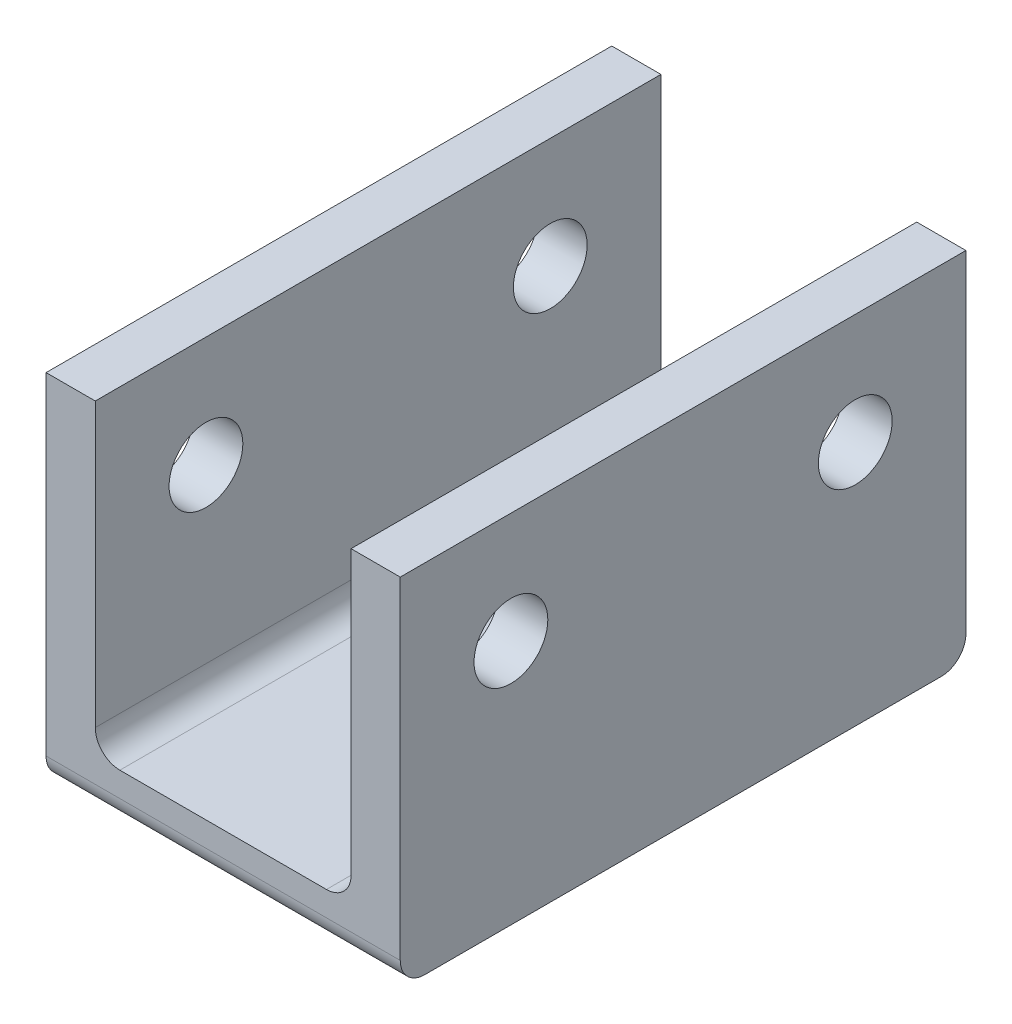
ISO-10303-21;
HEADER;
FILE_DESCRIPTION(('STEP AP214'),'2;1');
FILE_NAME('part.step','',(''),(''),'','','');
FILE_SCHEMA(('AUTOMOTIVE_DESIGN { 1 0 10303 214 1 1 1 1 }'));
ENDSEC;
DATA;
#1=APPLICATION_CONTEXT('core data for automotive mechanical design processes');
#2=APPLICATION_PROTOCOL_DEFINITION('international standard','automotive_design',2000,#1);
#3=PRODUCT_CONTEXT('',#1,'mechanical');
#4=PRODUCT('Part','Part','',(#3));
#5=PRODUCT_RELATED_PRODUCT_CATEGORY('part','',(#4));
#6=PRODUCT_DEFINITION_FORMATION('','',#4);
#7=PRODUCT_DEFINITION_CONTEXT('part definition',#1,'design');
#8=PRODUCT_DEFINITION('design','',#6,#7);
#9=PRODUCT_DEFINITION_SHAPE('','',#8);
#10=(LENGTH_UNIT() NAMED_UNIT(*) SI_UNIT(.MILLI.,.METRE.));
#11=(NAMED_UNIT(*) PLANE_ANGLE_UNIT() SI_UNIT($,.RADIAN.));
#12=(NAMED_UNIT(*) SI_UNIT($,.STERADIAN.) SOLID_ANGLE_UNIT());
#13=UNCERTAINTY_MEASURE_WITH_UNIT(LENGTH_MEASURE(1.E-05),#10,'distance_accuracy_value','');
#14=(GEOMETRIC_REPRESENTATION_CONTEXT(3) GLOBAL_UNCERTAINTY_ASSIGNED_CONTEXT((#13)) GLOBAL_UNIT_ASSIGNED_CONTEXT((#10,
#11,#12)) REPRESENTATION_CONTEXT('',''));
#15=CARTESIAN_POINT('',(0.,0.,0.));
#16=DIRECTION('',(0.,0.,1.));
#17=DIRECTION('',(1.,0.,0.));
#18=AXIS2_PLACEMENT_3D('',#15,#16,#17);
#19=CARTESIAN_POINT('',(-5.2,1.,11.5));
#20=DIRECTION('',(-1.,0.,0.));
#21=DIRECTION('',(0.,-1.,0.));
#22=AXIS2_PLACEMENT_3D('',#19,#20,#21);
#23=PLANE('',#22);
#24=CARTESIAN_POINT('',(-5.2,9.,7.));
#25=DIRECTION('',(-1.,0.,0.));
#26=DIRECTION('',(0.,-1.,0.));
#27=AXIS2_PLACEMENT_3D('',#24,#25,#26);
#28=CIRCLE('',#27,1.5);
#29=CARTESIAN_POINT('',(-5.2,7.5,7.));
#30=VERTEX_POINT('',#29);
#31=EDGE_CURVE('E255',#30,#30,#28,.T.);
#32=ORIENTED_EDGE('',*,*,#31,.T.);
#33=EDGE_LOOP('',(#32));
#34=FACE_BOUND('',#33,.T.);
#35=CARTESIAN_POINT('',(-5.2,9.,-7.));
#36=DIRECTION('',(-1.,0.,0.));
#37=DIRECTION('',(0.,-1.,0.));
#38=AXIS2_PLACEMENT_3D('',#35,#36,#37);
#39=CIRCLE('',#38,1.5);
#40=CARTESIAN_POINT('',(-5.2,7.5,-7.));
#41=VERTEX_POINT('',#40);
#42=EDGE_CURVE('E165',#41,#41,#39,.T.);
#43=ORIENTED_EDGE('',*,*,#42,.T.);
#44=EDGE_LOOP('',(#43));
#45=FACE_BOUND('',#44,.T.);
#46=DIRECTION('',(0.,1.,0.));
#47=VECTOR('',#46,1.);
#48=CARTESIAN_POINT('',(-5.2,1.,11.5));
#49=LINE('',#48,#47);
#50=CARTESIAN_POINT('',(-5.2,2.,11.5));
#51=VERTEX_POINT('',#50);
#52=CARTESIAN_POINT('',(-5.2,13.5,11.5));
#53=VERTEX_POINT('',#52);
#54=EDGE_CURVE('E121',#51,#53,#49,.T.);
#55=ORIENTED_EDGE('',*,*,#54,.F.);
#56=DIRECTION('',(0.,0.,-1.));
#57=VECTOR('',#56,1.);
#58=CARTESIAN_POINT('',(-5.2,2.,-11.5));
#59=LINE('',#58,#57);
#60=CARTESIAN_POINT('',(-5.2,2.,-11.5));
#61=VERTEX_POINT('',#60);
#62=EDGE_CURVE('E181',#51,#61,#59,.T.);
#63=ORIENTED_EDGE('',*,*,#62,.T.);
#64=DIRECTION('',(0.,1.,0.));
#65=VECTOR('',#64,1.);
#66=CARTESIAN_POINT('',(-5.2,1.,-11.5));
#67=LINE('',#66,#65);
#68=CARTESIAN_POINT('',(-5.2,13.5,-11.5));
#69=VERTEX_POINT('',#68);
#70=EDGE_CURVE('E146',#61,#69,#67,.T.);
#71=ORIENTED_EDGE('',*,*,#70,.T.);
#72=DIRECTION('',(0.,0.,-1.));
#73=VECTOR('',#72,1.);
#74=CARTESIAN_POINT('',(-5.2,13.5,11.5));
#75=LINE('',#74,#73);
#76=EDGE_CURVE('E139',#53,#69,#75,.T.);
#77=ORIENTED_EDGE('',*,*,#76,.F.);
#78=EDGE_LOOP('',(#55,#63,#71,#77));
#79=FACE_BOUND('',#78,.T.);
#80=ADVANCED_FACE('F33',(#34,#45,#79),#23,.F.);
#81=CARTESIAN_POINT('',(-5.2,13.5,11.5));
#82=DIRECTION('',(0.,-1.,0.));
#83=DIRECTION('',(0.,0.,-1.));
#84=AXIS2_PLACEMENT_3D('',#81,#82,#83);
#85=PLANE('',#84);
#86=DIRECTION('',(-1.,0.,0.));
#87=VECTOR('',#86,1.);
#88=CARTESIAN_POINT('',(-5.2,13.5,-11.5));
#89=LINE('',#88,#87);
#90=CARTESIAN_POINT('',(-7.2,13.5,-11.5));
#91=VERTEX_POINT('',#90);
#92=EDGE_CURVE('E254',#69,#91,#89,.T.);
#93=ORIENTED_EDGE('',*,*,#92,.T.);
#94=DIRECTION('',(0.,0.,-1.));
#95=VECTOR('',#94,1.);
#96=CARTESIAN_POINT('',(-7.2,13.5,11.5));
#97=LINE('',#96,#95);
#98=CARTESIAN_POINT('',(-7.2,13.5,11.5));
#99=VERTEX_POINT('',#98);
#100=EDGE_CURVE('E141',#99,#91,#97,.T.);
#101=ORIENTED_EDGE('',*,*,#100,.F.);
#102=DIRECTION('',(-1.,0.,0.));
#103=VECTOR('',#102,1.);
#104=CARTESIAN_POINT('',(-5.2,13.5,11.5));
#105=LINE('',#104,#103);
#106=EDGE_CURVE('E125',#53,#99,#105,.T.);
#107=ORIENTED_EDGE('',*,*,#106,.F.);
#108=ORIENTED_EDGE('',*,*,#76,.T.);
#109=EDGE_LOOP('',(#93,#101,#107,#108));
#110=FACE_BOUND('',#109,.T.);
#111=ADVANCED_FACE('F138',(#110),#85,.F.);
#112=CARTESIAN_POINT('',(-7.2,13.5,11.5));
#113=DIRECTION('',(1.,0.,0.));
#114=DIRECTION('',(0.,1.,0.));
#115=AXIS2_PLACEMENT_3D('',#112,#113,#114);
#116=PLANE('',#115);
#117=CARTESIAN_POINT('',(-7.2,9.,7.));
#118=DIRECTION('',(1.,0.,0.));
#119=DIRECTION('',(0.,1.,0.));
#120=AXIS2_PLACEMENT_3D('',#117,#118,#119);
#121=CIRCLE('',#120,1.5);
#122=CARTESIAN_POINT('',(-7.2,10.5,7.));
#123=VERTEX_POINT('',#122);
#124=EDGE_CURVE('E161',#123,#123,#121,.T.);
#125=ORIENTED_EDGE('',*,*,#124,.T.);
#126=EDGE_LOOP('',(#125));
#127=FACE_BOUND('',#126,.T.);
#128=CARTESIAN_POINT('',(-7.2,9.,-7.));
#129=DIRECTION('',(1.,0.,0.));
#130=DIRECTION('',(0.,-1.,0.));
#131=AXIS2_PLACEMENT_3D('',#128,#129,#130);
#132=CIRCLE('',#131,1.5);
#133=CARTESIAN_POINT('',(-7.2,7.5,-7.));
#134=VERTEX_POINT('',#133);
#135=EDGE_CURVE('E314',#134,#134,#132,.T.);
#136=ORIENTED_EDGE('',*,*,#135,.T.);
#137=EDGE_LOOP('',(#136));
#138=FACE_BOUND('',#137,.T.);
#139=DIRECTION('',(0.,0.,-1.));
#140=VECTOR('',#139,1.);
#141=CARTESIAN_POINT('',(-7.2,-1.,11.5));
#142=LINE('',#141,#140);
#143=CARTESIAN_POINT('',(-7.2,-1.,10.5));
#144=VERTEX_POINT('',#143);
#145=CARTESIAN_POINT('',(-7.2,-1.,-10.5));
#146=VERTEX_POINT('',#145);
#147=EDGE_CURVE('E153',#144,#146,#142,.T.);
#148=ORIENTED_EDGE('',*,*,#147,.F.);
#149=CARTESIAN_POINT('',(-7.2,0.,10.5));
#150=DIRECTION('',(1.,0.,0.));
#151=DIRECTION('',(0.,1.,0.));
#152=AXIS2_PLACEMENT_3D('',#149,#150,#151);
#153=CIRCLE('',#152,1.);
#154=CARTESIAN_POINT('',(-7.2,0.,11.5));
#155=VERTEX_POINT('',#154);
#156=EDGE_CURVE('E177',#144,#155,#153,.F.);
#157=ORIENTED_EDGE('',*,*,#156,.T.);
#158=DIRECTION('',(0.,-1.,0.));
#159=VECTOR('',#158,1.);
#160=CARTESIAN_POINT('',(-7.2,13.5,11.5));
#161=LINE('',#160,#159);
#162=EDGE_CURVE('E143',#99,#155,#161,.T.);
#163=ORIENTED_EDGE('',*,*,#162,.F.);
#164=ORIENTED_EDGE('',*,*,#100,.T.);
#165=DIRECTION('',(0.,-1.,0.));
#166=VECTOR('',#165,1.);
#167=CARTESIAN_POINT('',(-7.2,13.5,-11.5));
#168=LINE('',#167,#166);
#169=CARTESIAN_POINT('',(-7.2,0.,-11.5));
#170=VERTEX_POINT('',#169);
#171=EDGE_CURVE('E257',#91,#170,#168,.T.);
#172=ORIENTED_EDGE('',*,*,#171,.T.);
#173=CARTESIAN_POINT('',(-7.2,0.,-10.5));
#174=DIRECTION('',(1.,0.,0.));
#175=DIRECTION('',(0.,1.,0.));
#176=AXIS2_PLACEMENT_3D('',#173,#174,#175);
#177=CIRCLE('',#176,1.);
#178=EDGE_CURVE('E175',#170,#146,#177,.F.);
#179=ORIENTED_EDGE('',*,*,#178,.T.);
#180=EDGE_LOOP('',(#148,#157,#163,#164,#172,#179));
#181=FACE_BOUND('',#180,.T.);
#182=ADVANCED_FACE('F219',(#127,#138,#181),#116,.F.);
#183=CARTESIAN_POINT('',(7.2,-1.,11.5));
#184=DIRECTION('',(0.,1.,0.));
#185=DIRECTION('',(0.,0.,1.));
#186=AXIS2_PLACEMENT_3D('',#183,#184,#185);
#187=PLANE('',#186);
#188=DIRECTION('',(0.,0.,-1.));
#189=VECTOR('',#188,1.);
#190=CARTESIAN_POINT('',(7.2,-1.,11.5));
#191=LINE('',#190,#189);
#192=CARTESIAN_POINT('',(7.2,-1.,10.5));
#193=VERTEX_POINT('',#192);
#194=CARTESIAN_POINT('',(7.2,-1.,-10.5));
#195=VERTEX_POINT('',#194);
#196=EDGE_CURVE('E270',#193,#195,#191,.T.);
#197=ORIENTED_EDGE('',*,*,#196,.F.);
#198=DIRECTION('',(1.,0.,0.));
#199=VECTOR('',#198,1.);
#200=CARTESIAN_POINT('',(-7.2,-1.,10.5));
#201=LINE('',#200,#199);
#202=EDGE_CURVE('E173',#193,#144,#201,.F.);
#203=ORIENTED_EDGE('',*,*,#202,.T.);
#204=ORIENTED_EDGE('',*,*,#147,.T.);
#205=DIRECTION('',(1.,0.,0.));
#206=VECTOR('',#205,1.);
#207=CARTESIAN_POINT('',(7.2,-1.,-10.5));
#208=LINE('',#207,#206);
#209=EDGE_CURVE('E170',#146,#195,#208,.T.);
#210=ORIENTED_EDGE('',*,*,#209,.T.);
#211=EDGE_LOOP('',(#197,#203,#204,#210));
#212=FACE_BOUND('',#211,.T.);
#213=ADVANCED_FACE('F275',(#212),#187,.F.);
#214=CARTESIAN_POINT('',(7.2,13.5,11.5));
#215=DIRECTION('',(-1.,0.,0.));
#216=DIRECTION('',(0.,-1.,0.));
#217=AXIS2_PLACEMENT_3D('',#214,#215,#216);
#218=PLANE('',#217);
#219=CARTESIAN_POINT('',(7.2,9.,7.));
#220=DIRECTION('',(-1.,0.,0.));
#221=DIRECTION('',(0.,-1.,0.));
#222=AXIS2_PLACEMENT_3D('',#219,#220,#221);
#223=CIRCLE('',#222,1.5);
#224=CARTESIAN_POINT('',(7.2,7.5,7.));
#225=VERTEX_POINT('',#224);
#226=EDGE_CURVE('E164',#225,#225,#223,.T.);
#227=ORIENTED_EDGE('',*,*,#226,.T.);
#228=EDGE_LOOP('',(#227));
#229=FACE_BOUND('',#228,.T.);
#230=CARTESIAN_POINT('',(7.2,9.,-7.));
#231=DIRECTION('',(-1.,0.,0.));
#232=DIRECTION('',(0.,-1.,0.));
#233=AXIS2_PLACEMENT_3D('',#230,#231,#232);
#234=CIRCLE('',#233,1.5);
#235=CARTESIAN_POINT('',(7.2,7.5,-7.));
#236=VERTEX_POINT('',#235);
#237=EDGE_CURVE('E160',#236,#236,#234,.T.);
#238=ORIENTED_EDGE('',*,*,#237,.T.);
#239=EDGE_LOOP('',(#238));
#240=FACE_BOUND('',#239,.T.);
#241=DIRECTION('',(0.,1.,0.));
#242=VECTOR('',#241,1.);
#243=CARTESIAN_POINT('',(7.2,13.5,11.5));
#244=LINE('',#243,#242);
#245=CARTESIAN_POINT('',(7.2,0.,11.5));
#246=VERTEX_POINT('',#245);
#247=CARTESIAN_POINT('',(7.2,13.5,11.5));
#248=VERTEX_POINT('',#247);
#249=EDGE_CURVE('E242',#246,#248,#244,.T.);
#250=ORIENTED_EDGE('',*,*,#249,.F.);
#251=CARTESIAN_POINT('',(7.2,0.,10.5));
#252=DIRECTION('',(-1.,0.,0.));
#253=DIRECTION('',(0.,-1.,0.));
#254=AXIS2_PLACEMENT_3D('',#251,#252,#253);
#255=CIRCLE('',#254,1.);
#256=EDGE_CURVE('E168',#246,#193,#255,.F.);
#257=ORIENTED_EDGE('',*,*,#256,.T.);
#258=ORIENTED_EDGE('',*,*,#196,.T.);
#259=CARTESIAN_POINT('',(7.2,0.,-10.5));
#260=DIRECTION('',(-1.,0.,0.));
#261=DIRECTION('',(0.,-1.,0.));
#262=AXIS2_PLACEMENT_3D('',#259,#260,#261);
#263=CIRCLE('',#262,1.);
#264=CARTESIAN_POINT('',(7.2,0.,-11.5));
#265=VERTEX_POINT('',#264);
#266=EDGE_CURVE('E151',#195,#265,#263,.F.);
#267=ORIENTED_EDGE('',*,*,#266,.T.);
#268=DIRECTION('',(0.,1.,0.));
#269=VECTOR('',#268,1.);
#270=CARTESIAN_POINT('',(7.2,13.5,-11.5));
#271=LINE('',#270,#269);
#272=CARTESIAN_POINT('',(7.2,13.5,-11.5));
#273=VERTEX_POINT('',#272);
#274=EDGE_CURVE('E260',#265,#273,#271,.T.);
#275=ORIENTED_EDGE('',*,*,#274,.T.);
#276=DIRECTION('',(0.,0.,-1.));
#277=VECTOR('',#276,1.);
#278=CARTESIAN_POINT('',(7.2,13.5,11.5));
#279=LINE('',#278,#277);
#280=EDGE_CURVE('E267',#248,#273,#279,.T.);
#281=ORIENTED_EDGE('',*,*,#280,.F.);
#282=EDGE_LOOP('',(#250,#257,#258,#267,#275,#281));
#283=FACE_BOUND('',#282,.T.);
#284=ADVANCED_FACE('F279',(#229,#240,#283),#218,.F.);
#285=CARTESIAN_POINT('',(5.2,13.5,11.5));
#286=DIRECTION('',(0.,-1.,0.));
#287=DIRECTION('',(0.,0.,-1.));
#288=AXIS2_PLACEMENT_3D('',#285,#286,#287);
#289=PLANE('',#288);
#290=DIRECTION('',(-1.,0.,0.));
#291=VECTOR('',#290,1.);
#292=CARTESIAN_POINT('',(5.2,13.5,-11.5));
#293=LINE('',#292,#291);
#294=CARTESIAN_POINT('',(5.2,13.5,-11.5));
#295=VERTEX_POINT('',#294);
#296=EDGE_CURVE('E262',#273,#295,#293,.T.);
#297=ORIENTED_EDGE('',*,*,#296,.T.);
#298=DIRECTION('',(0.,0.,-1.));
#299=VECTOR('',#298,1.);
#300=CARTESIAN_POINT('',(5.2,13.5,11.5));
#301=LINE('',#300,#299);
#302=CARTESIAN_POINT('',(5.2,13.5,11.5));
#303=VERTEX_POINT('',#302);
#304=EDGE_CURVE('E252',#303,#295,#301,.T.);
#305=ORIENTED_EDGE('',*,*,#304,.F.);
#306=DIRECTION('',(-1.,0.,0.));
#307=VECTOR('',#306,1.);
#308=CARTESIAN_POINT('',(5.2,13.5,11.5));
#309=LINE('',#308,#307);
#310=EDGE_CURVE('E244',#248,#303,#309,.T.);
#311=ORIENTED_EDGE('',*,*,#310,.F.);
#312=ORIENTED_EDGE('',*,*,#280,.T.);
#313=EDGE_LOOP('',(#297,#305,#311,#312));
#314=FACE_BOUND('',#313,.T.);
#315=ADVANCED_FACE('F285',(#314),#289,.F.);
#316=CARTESIAN_POINT('',(5.2,1.,11.5));
#317=DIRECTION('',(1.,0.,0.));
#318=DIRECTION('',(0.,1.,0.));
#319=AXIS2_PLACEMENT_3D('',#316,#317,#318);
#320=PLANE('',#319);
#321=CARTESIAN_POINT('',(5.2,9.,7.));
#322=DIRECTION('',(1.,0.,0.));
#323=DIRECTION('',(0.,1.,0.));
#324=AXIS2_PLACEMENT_3D('',#321,#322,#323);
#325=CIRCLE('',#324,1.5);
#326=CARTESIAN_POINT('',(5.2,10.5,7.));
#327=VERTEX_POINT('',#326);
#328=EDGE_CURVE('E162',#327,#327,#325,.T.);
#329=ORIENTED_EDGE('',*,*,#328,.T.);
#330=EDGE_LOOP('',(#329));
#331=FACE_BOUND('',#330,.T.);
#332=CARTESIAN_POINT('',(5.2,9.,-7.));
#333=DIRECTION('',(1.,0.,0.));
#334=DIRECTION('',(0.,1.,0.));
#335=AXIS2_PLACEMENT_3D('',#332,#333,#334);
#336=CIRCLE('',#335,1.5);
#337=CARTESIAN_POINT('',(5.2,10.5,-7.));
#338=VERTEX_POINT('',#337);
#339=EDGE_CURVE('E157',#338,#338,#336,.T.);
#340=ORIENTED_EDGE('',*,*,#339,.T.);
#341=EDGE_LOOP('',(#340));
#342=FACE_BOUND('',#341,.T.);
#343=DIRECTION('',(0.,-1.,0.));
#344=VECTOR('',#343,1.);
#345=CARTESIAN_POINT('',(5.2,1.,-11.5));
#346=LINE('',#345,#344);
#347=CARTESIAN_POINT('',(5.2,2.,-11.5));
#348=VERTEX_POINT('',#347);
#349=EDGE_CURVE('E200',#295,#348,#346,.T.);
#350=ORIENTED_EDGE('',*,*,#349,.T.);
#351=DIRECTION('',(0.,0.,-1.));
#352=VECTOR('',#351,1.);
#353=CARTESIAN_POINT('',(5.2,2.,11.5));
#354=LINE('',#353,#352);
#355=CARTESIAN_POINT('',(5.2,2.,11.5));
#356=VERTEX_POINT('',#355);
#357=EDGE_CURVE('E48',#348,#356,#354,.F.);
#358=ORIENTED_EDGE('',*,*,#357,.T.);
#359=DIRECTION('',(0.,-1.,0.));
#360=VECTOR('',#359,1.);
#361=CARTESIAN_POINT('',(5.2,1.,11.5));
#362=LINE('',#361,#360);
#363=EDGE_CURVE('E248',#303,#356,#362,.T.);
#364=ORIENTED_EDGE('',*,*,#363,.F.);
#365=ORIENTED_EDGE('',*,*,#304,.T.);
#366=EDGE_LOOP('',(#350,#358,#364,#365));
#367=FACE_BOUND('',#366,.T.);
#368=ADVANCED_FACE('F287',(#331,#342,#367),#320,.F.);
#369=CARTESIAN_POINT('',(-5.2,1.,11.5));
#370=DIRECTION('',(0.,-1.,0.));
#371=DIRECTION('',(0.,0.,-1.));
#372=AXIS2_PLACEMENT_3D('',#369,#370,#371);
#373=PLANE('',#372);
#374=DIRECTION('',(-1.,0.,0.));
#375=VECTOR('',#374,1.);
#376=CARTESIAN_POINT('',(-5.2,1.,-11.5));
#377=LINE('',#376,#375);
#378=CARTESIAN_POINT('',(4.2,1.,-11.5));
#379=VERTEX_POINT('',#378);
#380=CARTESIAN_POINT('',(-4.2,1.,-11.5));
#381=VERTEX_POINT('',#380);
#382=EDGE_CURVE('E134',#379,#381,#377,.T.);
#383=ORIENTED_EDGE('',*,*,#382,.T.);
#384=DIRECTION('',(0.,0.,-1.));
#385=VECTOR('',#384,1.);
#386=CARTESIAN_POINT('',(-4.2,1.,11.5));
#387=LINE('',#386,#385);
#388=CARTESIAN_POINT('',(-4.2,1.,11.5));
#389=VERTEX_POINT('',#388);
#390=EDGE_CURVE('E186',#381,#389,#387,.F.);
#391=ORIENTED_EDGE('',*,*,#390,.T.);
#392=DIRECTION('',(-1.,0.,0.));
#393=VECTOR('',#392,1.);
#394=CARTESIAN_POINT('',(-5.2,1.,11.5));
#395=LINE('',#394,#393);
#396=CARTESIAN_POINT('',(4.2,1.,11.5));
#397=VERTEX_POINT('',#396);
#398=EDGE_CURVE('E250',#397,#389,#395,.T.);
#399=ORIENTED_EDGE('',*,*,#398,.F.);
#400=DIRECTION('',(0.,0.,-1.));
#401=VECTOR('',#400,1.);
#402=CARTESIAN_POINT('',(4.2,1.,-11.5));
#403=LINE('',#402,#401);
#404=EDGE_CURVE('E183',#397,#379,#403,.T.);
#405=ORIENTED_EDGE('',*,*,#404,.T.);
#406=EDGE_LOOP('',(#383,#391,#399,#405));
#407=FACE_BOUND('',#406,.T.);
#408=ADVANCED_FACE('F197',(#407),#373,.F.);
#409=CARTESIAN_POINT('',(0.,0.,11.5));
#410=DIRECTION('',(0.,0.,1.));
#411=DIRECTION('',(1.,0.,0.));
#412=AXIS2_PLACEMENT_3D('',#409,#410,#411);
#413=PLANE('',#412);
#414=ORIENTED_EDGE('',*,*,#162,.T.);
#415=DIRECTION('',(1.,0.,0.));
#416=VECTOR('',#415,1.);
#417=CARTESIAN_POINT('',(7.2,0.,11.5));
#418=LINE('',#417,#416);
#419=EDGE_CURVE('E148',#155,#246,#418,.T.);
#420=ORIENTED_EDGE('',*,*,#419,.T.);
#421=ORIENTED_EDGE('',*,*,#249,.T.);
#422=ORIENTED_EDGE('',*,*,#310,.T.);
#423=ORIENTED_EDGE('',*,*,#363,.T.);
#424=CARTESIAN_POINT('',(4.2,2.,11.5));
#425=DIRECTION('',(0.,0.,1.));
#426=DIRECTION('',(1.,0.,0.));
#427=AXIS2_PLACEMENT_3D('',#424,#425,#426);
#428=CIRCLE('',#427,1.);
#429=EDGE_CURVE('E11',#356,#397,#428,.F.);
#430=ORIENTED_EDGE('',*,*,#429,.T.);
#431=ORIENTED_EDGE('',*,*,#398,.T.);
#432=CARTESIAN_POINT('',(-4.2,2.,11.5));
#433=DIRECTION('',(0.,0.,1.));
#434=DIRECTION('',(1.,0.,0.));
#435=AXIS2_PLACEMENT_3D('',#432,#433,#434);
#436=CIRCLE('',#435,1.);
#437=EDGE_CURVE('E129',#389,#51,#436,.F.);
#438=ORIENTED_EDGE('',*,*,#437,.T.);
#439=ORIENTED_EDGE('',*,*,#54,.T.);
#440=ORIENTED_EDGE('',*,*,#106,.T.);
#441=EDGE_LOOP('',(#414,#420,#421,#422,#423,#430,#431,#438,#439,#440));
#442=FACE_BOUND('',#441,.T.);
#443=ADVANCED_FACE('F124',(#442),#413,.T.);
#444=CARTESIAN_POINT('',(0.,0.,-11.5));
#445=DIRECTION('',(0.,0.,1.));
#446=DIRECTION('',(1.,0.,0.));
#447=AXIS2_PLACEMENT_3D('',#444,#445,#446);
#448=PLANE('',#447);
#449=ORIENTED_EDGE('',*,*,#274,.F.);
#450=DIRECTION('',(1.,0.,0.));
#451=VECTOR('',#450,1.);
#452=CARTESIAN_POINT('',(0.,0.,-11.5));
#453=LINE('',#452,#451);
#454=EDGE_CURVE('E179',#265,#170,#453,.F.);
#455=ORIENTED_EDGE('',*,*,#454,.T.);
#456=ORIENTED_EDGE('',*,*,#171,.F.);
#457=ORIENTED_EDGE('',*,*,#92,.F.);
#458=ORIENTED_EDGE('',*,*,#70,.F.);
#459=CARTESIAN_POINT('',(-4.2,2.,-11.5));
#460=DIRECTION('',(0.,0.,1.));
#461=DIRECTION('',(1.,0.,0.));
#462=AXIS2_PLACEMENT_3D('',#459,#460,#461);
#463=CIRCLE('',#462,1.);
#464=EDGE_CURVE('E189',#61,#381,#463,.T.);
#465=ORIENTED_EDGE('',*,*,#464,.T.);
#466=ORIENTED_EDGE('',*,*,#382,.F.);
#467=CARTESIAN_POINT('',(4.2,2.,-11.5));
#468=DIRECTION('',(0.,0.,1.));
#469=DIRECTION('',(1.,0.,0.));
#470=AXIS2_PLACEMENT_3D('',#467,#468,#469);
#471=CIRCLE('',#470,1.);
#472=EDGE_CURVE('E41',#379,#348,#471,.T.);
#473=ORIENTED_EDGE('',*,*,#472,.T.);
#474=ORIENTED_EDGE('',*,*,#349,.F.);
#475=ORIENTED_EDGE('',*,*,#296,.F.);
#476=EDGE_LOOP('',(#449,#455,#456,#457,#458,#465,#466,#473,#474,#475));
#477=FACE_BOUND('',#476,.T.);
#478=ADVANCED_FACE('F193',(#477),#448,.F.);
#479=CARTESIAN_POINT('',(-7.2,9.,-7.));
#480=DIRECTION('',(1.,0.,0.));
#481=DIRECTION('',(0.,1.,0.));
#482=AXIS2_PLACEMENT_3D('',#479,#480,#481);
#483=CYLINDRICAL_SURFACE('',#482,1.5);
#484=ORIENTED_EDGE('',*,*,#339,.F.);
#485=EDGE_LOOP('',(#484));
#486=FACE_BOUND('',#485,.T.);
#487=ORIENTED_EDGE('',*,*,#237,.F.);
#488=EDGE_LOOP('',(#487));
#489=FACE_BOUND('',#488,.T.);
#490=ADVANCED_FACE('F331',(#486,#489),#483,.F.);
#491=CARTESIAN_POINT('',(-7.2,9.,7.));
#492=DIRECTION('',(1.,0.,0.));
#493=DIRECTION('',(0.,1.,0.));
#494=AXIS2_PLACEMENT_3D('',#491,#492,#493);
#495=CYLINDRICAL_SURFACE('',#494,1.5);
#496=ORIENTED_EDGE('',*,*,#328,.F.);
#497=EDGE_LOOP('',(#496));
#498=FACE_BOUND('',#497,.T.);
#499=ORIENTED_EDGE('',*,*,#226,.F.);
#500=EDGE_LOOP('',(#499));
#501=FACE_BOUND('',#500,.T.);
#502=ADVANCED_FACE('F234',(#498,#501),#495,.F.);
#503=ORIENTED_EDGE('',*,*,#135,.F.);
#504=EDGE_LOOP('',(#503));
#505=FACE_BOUND('',#504,.T.);
#506=ORIENTED_EDGE('',*,*,#42,.F.);
#507=EDGE_LOOP('',(#506));
#508=FACE_BOUND('',#507,.T.);
#509=ADVANCED_FACE('F231',(#505,#508),#483,.F.);
#510=ORIENTED_EDGE('',*,*,#124,.F.);
#511=EDGE_LOOP('',(#510));
#512=FACE_BOUND('',#511,.T.);
#513=ORIENTED_EDGE('',*,*,#31,.F.);
#514=EDGE_LOOP('',(#513));
#515=FACE_BOUND('',#514,.T.);
#516=ADVANCED_FACE('F226',(#512,#515),#495,.F.);
#517=CARTESIAN_POINT('',(0.,0.,10.5));
#518=DIRECTION('',(-1.,0.,0.));
#519=DIRECTION('',(0.,0.,1.));
#520=AXIS2_PLACEMENT_3D('',#517,#518,#519);
#521=CYLINDRICAL_SURFACE('',#520,1.);
#522=ORIENTED_EDGE('',*,*,#156,.F.);
#523=ORIENTED_EDGE('',*,*,#202,.F.);
#524=ORIENTED_EDGE('',*,*,#256,.F.);
#525=ORIENTED_EDGE('',*,*,#419,.F.);
#526=EDGE_LOOP('',(#522,#523,#524,#525));
#527=FACE_BOUND('',#526,.T.);
#528=ADVANCED_FACE('F210',(#527),#521,.T.);
#529=CARTESIAN_POINT('',(7.2,0.,-10.5));
#530=DIRECTION('',(1.,0.,0.));
#531=DIRECTION('',(0.,0.,-1.));
#532=AXIS2_PLACEMENT_3D('',#529,#530,#531);
#533=CYLINDRICAL_SURFACE('',#532,1.);
#534=ORIENTED_EDGE('',*,*,#178,.F.);
#535=ORIENTED_EDGE('',*,*,#454,.F.);
#536=ORIENTED_EDGE('',*,*,#266,.F.);
#537=ORIENTED_EDGE('',*,*,#209,.F.);
#538=EDGE_LOOP('',(#534,#535,#536,#537));
#539=FACE_BOUND('',#538,.T.);
#540=ADVANCED_FACE('F204',(#539),#533,.T.);
#541=CARTESIAN_POINT('',(-4.2,2.,11.5));
#542=DIRECTION('',(0.,0.,1.));
#543=DIRECTION('',(1.,0.,0.));
#544=AXIS2_PLACEMENT_3D('',#541,#542,#543);
#545=CYLINDRICAL_SURFACE('',#544,1.);
#546=ORIENTED_EDGE('',*,*,#437,.F.);
#547=ORIENTED_EDGE('',*,*,#390,.F.);
#548=ORIENTED_EDGE('',*,*,#464,.F.);
#549=ORIENTED_EDGE('',*,*,#62,.F.);
#550=EDGE_LOOP('',(#546,#547,#548,#549));
#551=FACE_BOUND('',#550,.T.);
#552=ADVANCED_FACE('F202',(#551),#545,.F.);
#553=CARTESIAN_POINT('',(4.2,2.,11.5));
#554=DIRECTION('',(0.,0.,1.));
#555=DIRECTION('',(1.,0.,0.));
#556=AXIS2_PLACEMENT_3D('',#553,#554,#555);
#557=CYLINDRICAL_SURFACE('',#556,1.);
#558=ORIENTED_EDGE('',*,*,#429,.F.);
#559=ORIENTED_EDGE('',*,*,#357,.F.);
#560=ORIENTED_EDGE('',*,*,#472,.F.);
#561=ORIENTED_EDGE('',*,*,#404,.F.);
#562=EDGE_LOOP('',(#558,#559,#560,#561));
#563=FACE_BOUND('',#562,.T.);
#564=ADVANCED_FACE('F35',(#563),#557,.F.);
#565=CLOSED_SHELL('',(#80,#111,#182,#213,#284,#315,#368,#408,#443,#478,#490,#502,#509,#516,#528,
#540,#552,#564));
#566=MANIFOLD_SOLID_BREP('B2',#565);
#567=ADVANCED_BREP_SHAPE_REPRESENTATION('',(#18,#566),#14);
#568=SHAPE_DEFINITION_REPRESENTATION(#9,#567);
ENDSEC;
END-ISO-10303-21;
